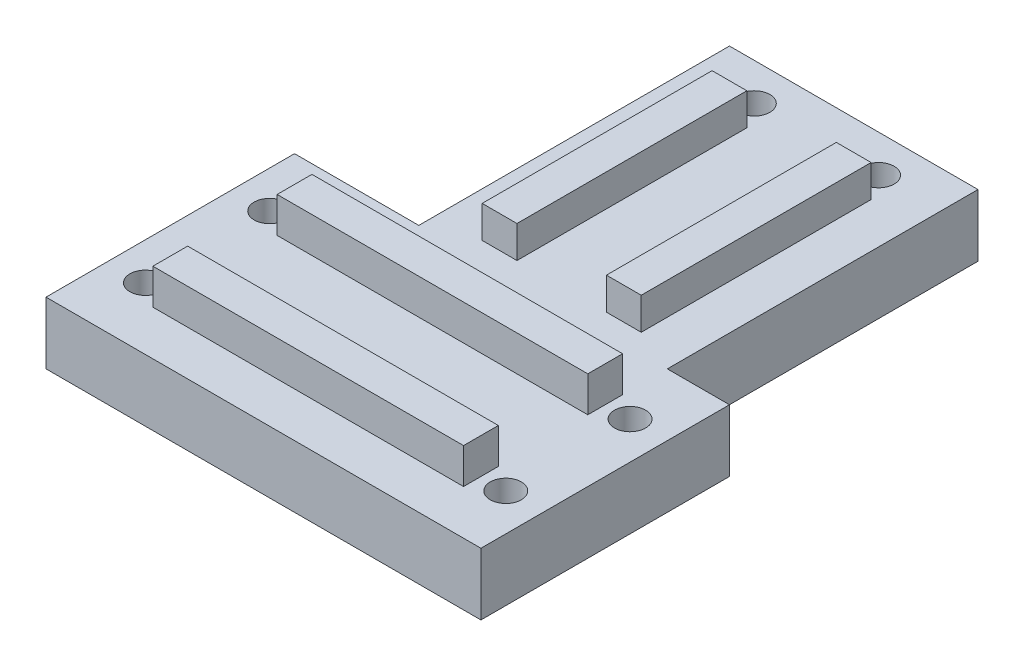
ISO-10303-21;
HEADER;
FILE_DESCRIPTION(('STEP AP214'),'2;1');
FILE_NAME('part.step','',(''),(''),'','','');
FILE_SCHEMA(('AUTOMOTIVE_DESIGN { 1 0 10303 214 1 1 1 1 }'));
ENDSEC;
DATA;
#1=APPLICATION_CONTEXT('core data for automotive mechanical design processes');
#2=APPLICATION_PROTOCOL_DEFINITION('international standard','automotive_design',2000,#1);
#3=PRODUCT_CONTEXT('',#1,'mechanical');
#4=PRODUCT('Part','Part','',(#3));
#5=PRODUCT_RELATED_PRODUCT_CATEGORY('part','',(#4));
#6=PRODUCT_DEFINITION_FORMATION('','',#4);
#7=PRODUCT_DEFINITION_CONTEXT('part definition',#1,'design');
#8=PRODUCT_DEFINITION('design','',#6,#7);
#9=PRODUCT_DEFINITION_SHAPE('','',#8);
#10=(LENGTH_UNIT() NAMED_UNIT(*) SI_UNIT(.MILLI.,.METRE.));
#11=(NAMED_UNIT(*) PLANE_ANGLE_UNIT() SI_UNIT($,.RADIAN.));
#12=(NAMED_UNIT(*) SI_UNIT($,.STERADIAN.) SOLID_ANGLE_UNIT());
#13=UNCERTAINTY_MEASURE_WITH_UNIT(LENGTH_MEASURE(1.E-05),#10,'distance_accuracy_value','');
#14=(GEOMETRIC_REPRESENTATION_CONTEXT(3) GLOBAL_UNCERTAINTY_ASSIGNED_CONTEXT((#13)) GLOBAL_UNIT_ASSIGNED_CONTEXT((#10,
#11,#12)) REPRESENTATION_CONTEXT('',''));
#15=CARTESIAN_POINT('',(0.,0.,0.));
#16=DIRECTION('',(0.,0.,1.));
#17=DIRECTION('',(1.,0.,0.));
#18=AXIS2_PLACEMENT_3D('',#15,#16,#17);
#19=CARTESIAN_POINT('',(30.,10.,7.2));
#20=DIRECTION('',(0.,0.,-1.));
#21=DIRECTION('',(-1.,0.,0.));
#22=AXIS2_PLACEMENT_3D('',#19,#20,#21);
#23=PLANE('',#22);
#24=DIRECTION('',(-1.,0.,0.));
#25=VECTOR('',#24,1.);
#26=CARTESIAN_POINT('',(30.,10.,7.2));
#27=LINE('',#26,#25);
#28=CARTESIAN_POINT('',(20.,10.,7.2));
#29=VERTEX_POINT('',#28);
#30=CARTESIAN_POINT('',(-30.,10.,7.2));
#31=VERTEX_POINT('',#30);
#32=EDGE_CURVE('E243',#29,#31,#27,.T.);
#33=ORIENTED_EDGE('',*,*,#32,.T.);
#34=DIRECTION('',(0.,1.,0.));
#35=VECTOR('',#34,1.);
#36=CARTESIAN_POINT('',(-30.,10.,7.2));
#37=LINE('',#36,#35);
#38=CARTESIAN_POINT('',(-30.,15.7111194530634,7.2));
#39=VERTEX_POINT('',#38);
#40=EDGE_CURVE('E200',#31,#39,#37,.T.);
#41=ORIENTED_EDGE('',*,*,#40,.T.);
#42=DIRECTION('',(-1.,0.,0.));
#43=VECTOR('',#42,1.);
#44=CARTESIAN_POINT('',(30.,15.7111194530634,7.2));
#45=LINE('',#44,#43);
#46=CARTESIAN_POINT('',(20.,15.7111194530634,7.2));
#47=VERTEX_POINT('',#46);
#48=EDGE_CURVE('E223',#47,#39,#45,.T.);
#49=ORIENTED_EDGE('',*,*,#48,.F.);
#50=DIRECTION('',(0.,-1.,0.));
#51=VECTOR('',#50,1.);
#52=CARTESIAN_POINT('',(20.,10.,7.2));
#53=LINE('',#52,#51);
#54=EDGE_CURVE('E288',#47,#29,#53,.T.);
#55=ORIENTED_EDGE('',*,*,#54,.T.);
#56=EDGE_LOOP('',(#33,#41,#49,#55));
#57=FACE_BOUND('',#56,.T.);
#58=ADVANCED_FACE('F34',(#57),#23,.T.);
#59=CARTESIAN_POINT('',(30.,15.7111194530634,7.2));
#60=DIRECTION('',(0.,1.,0.));
#61=DIRECTION('',(0.,0.,1.));
#62=AXIS2_PLACEMENT_3D('',#59,#60,#61);
#63=PLANE('',#62);
#64=ORIENTED_EDGE('',*,*,#48,.T.);
#65=DIRECTION('',(0.,0.,-1.));
#66=VECTOR('',#65,1.);
#67=CARTESIAN_POINT('',(-30.,15.7111194530634,20.));
#68=LINE('',#67,#66);
#69=CARTESIAN_POINT('',(-30.,15.7111194530634,12.8));
#70=VERTEX_POINT('',#69);
#71=EDGE_CURVE('E284',#70,#39,#68,.T.);
#72=ORIENTED_EDGE('',*,*,#71,.F.);
#73=DIRECTION('',(-1.,0.,0.));
#74=VECTOR('',#73,1.);
#75=CARTESIAN_POINT('',(30.,15.7111194530634,12.8));
#76=LINE('',#75,#74);
#77=CARTESIAN_POINT('',(20.,15.7111194530634,12.8));
#78=VERTEX_POINT('',#77);
#79=EDGE_CURVE('E215',#78,#70,#76,.T.);
#80=ORIENTED_EDGE('',*,*,#79,.F.);
#81=DIRECTION('',(0.,0.,1.));
#82=VECTOR('',#81,1.);
#83=CARTESIAN_POINT('',(20.,15.7111194530634,-20.));
#84=LINE('',#83,#82);
#85=EDGE_CURVE('E285',#47,#78,#84,.T.);
#86=ORIENTED_EDGE('',*,*,#85,.F.);
#87=EDGE_LOOP('',(#64,#72,#80,#86));
#88=FACE_BOUND('',#87,.T.);
#89=ADVANCED_FACE('F283',(#88),#63,.T.);
#90=CARTESIAN_POINT('',(30.,15.7111194530634,12.8));
#91=DIRECTION('',(0.,0.,1.));
#92=DIRECTION('',(0.,-1.,0.));
#93=AXIS2_PLACEMENT_3D('',#90,#91,#92);
#94=PLANE('',#93);
#95=ORIENTED_EDGE('',*,*,#79,.T.);
#96=DIRECTION('',(0.,-1.,0.));
#97=VECTOR('',#96,1.);
#98=CARTESIAN_POINT('',(-30.,15.7111194530634,12.8));
#99=LINE('',#98,#97);
#100=CARTESIAN_POINT('',(-30.,10.,12.8));
#101=VERTEX_POINT('',#100);
#102=EDGE_CURVE('E197',#70,#101,#99,.T.);
#103=ORIENTED_EDGE('',*,*,#102,.T.);
#104=DIRECTION('',(-1.,0.,0.));
#105=VECTOR('',#104,1.);
#106=CARTESIAN_POINT('',(30.,10.,12.8));
#107=LINE('',#106,#105);
#108=CARTESIAN_POINT('',(20.,10.,12.8));
#109=VERTEX_POINT('',#108);
#110=EDGE_CURVE('E213',#109,#101,#107,.T.);
#111=ORIENTED_EDGE('',*,*,#110,.F.);
#112=DIRECTION('',(0.,1.,0.));
#113=VECTOR('',#112,1.);
#114=CARTESIAN_POINT('',(20.,15.7111194530634,12.8));
#115=LINE('',#114,#113);
#116=EDGE_CURVE('E654',#109,#78,#115,.T.);
#117=ORIENTED_EDGE('',*,*,#116,.T.);
#118=EDGE_LOOP('',(#95,#103,#111,#117));
#119=FACE_BOUND('',#118,.T.);
#120=ADVANCED_FACE('F211',(#119),#94,.T.);
#121=CARTESIAN_POINT('',(30.,9.99999999999999,-12.8));
#122=DIRECTION('',(0.,0.,-1.));
#123=DIRECTION('',(-1.,0.,0.));
#124=AXIS2_PLACEMENT_3D('',#121,#122,#123);
#125=PLANE('',#124);
#126=DIRECTION('',(-1.,0.,0.));
#127=VECTOR('',#126,1.);
#128=CARTESIAN_POINT('',(30.,9.99999999999999,-12.8));
#129=LINE('',#128,#127);
#130=CARTESIAN_POINT('',(20.,10.,-12.8));
#131=VERTEX_POINT('',#130);
#132=CARTESIAN_POINT('',(-30.,10.,-12.8));
#133=VERTEX_POINT('',#132);
#134=EDGE_CURVE('E221',#131,#133,#129,.T.);
#135=ORIENTED_EDGE('',*,*,#134,.T.);
#136=DIRECTION('',(0.,1.,0.));
#137=VECTOR('',#136,1.);
#138=CARTESIAN_POINT('',(-30.,9.99999999999999,-12.8));
#139=LINE('',#138,#137);
#140=CARTESIAN_POINT('',(-30.,15.7111194530634,-12.8));
#141=VERTEX_POINT('',#140);
#142=EDGE_CURVE('E216',#133,#141,#139,.T.);
#143=ORIENTED_EDGE('',*,*,#142,.T.);
#144=DIRECTION('',(-1.,0.,0.));
#145=VECTOR('',#144,1.);
#146=CARTESIAN_POINT('',(30.,15.7111194530634,-12.8));
#147=LINE('',#146,#145);
#148=CARTESIAN_POINT('',(20.,15.7111194530634,-12.8));
#149=VERTEX_POINT('',#148);
#150=EDGE_CURVE('E226',#149,#141,#147,.T.);
#151=ORIENTED_EDGE('',*,*,#150,.F.);
#152=DIRECTION('',(0.,-1.,0.));
#153=VECTOR('',#152,1.);
#154=CARTESIAN_POINT('',(20.,9.99999999999999,-12.8));
#155=LINE('',#154,#153);
#156=EDGE_CURVE('E651',#149,#131,#155,.T.);
#157=ORIENTED_EDGE('',*,*,#156,.T.);
#158=EDGE_LOOP('',(#135,#143,#151,#157));
#159=FACE_BOUND('',#158,.T.);
#160=ADVANCED_FACE('F427',(#159),#125,.T.);
#161=CARTESIAN_POINT('',(30.,15.7111194530634,-12.8));
#162=DIRECTION('',(0.,1.,0.));
#163=DIRECTION('',(0.,0.,1.));
#164=AXIS2_PLACEMENT_3D('',#161,#162,#163);
#165=PLANE('',#164);
#166=ORIENTED_EDGE('',*,*,#150,.T.);
#167=CARTESIAN_POINT('',(-30.,15.7111194530634,-7.19999999999999));
#168=VERTEX_POINT('',#167);
#169=EDGE_CURVE('E205',#168,#141,#68,.T.);
#170=ORIENTED_EDGE('',*,*,#169,.F.);
#171=DIRECTION('',(-1.,0.,0.));
#172=VECTOR('',#171,1.);
#173=CARTESIAN_POINT('',(30.,15.7111194530634,-7.19999999999999));
#174=LINE('',#173,#172);
#175=CARTESIAN_POINT('',(20.,15.7111194530634,-7.19999999999999));
#176=VERTEX_POINT('',#175);
#177=EDGE_CURVE('E262',#176,#168,#174,.T.);
#178=ORIENTED_EDGE('',*,*,#177,.F.);
#179=EDGE_CURVE('E272',#149,#176,#84,.T.);
#180=ORIENTED_EDGE('',*,*,#179,.F.);
#181=EDGE_LOOP('',(#166,#170,#178,#180));
#182=FACE_BOUND('',#181,.T.);
#183=ADVANCED_FACE('F271',(#182),#165,.T.);
#184=CARTESIAN_POINT('',(30.,15.7111194530634,-7.19999999999999));
#185=DIRECTION('',(0.,0.,1.));
#186=DIRECTION('',(0.,-1.,0.));
#187=AXIS2_PLACEMENT_3D('',#184,#185,#186);
#188=PLANE('',#187);
#189=ORIENTED_EDGE('',*,*,#177,.T.);
#190=DIRECTION('',(0.,-1.,0.));
#191=VECTOR('',#190,1.);
#192=CARTESIAN_POINT('',(-30.,15.7111194530634,-7.19999999999999));
#193=LINE('',#192,#191);
#194=CARTESIAN_POINT('',(-30.,10.,-7.19999999999999));
#195=VERTEX_POINT('',#194);
#196=EDGE_CURVE('E11',#168,#195,#193,.T.);
#197=ORIENTED_EDGE('',*,*,#196,.T.);
#198=DIRECTION('',(-1.,0.,0.));
#199=VECTOR('',#198,1.);
#200=CARTESIAN_POINT('',(30.,9.99999999999999,-7.19999999999999));
#201=LINE('',#200,#199);
#202=CARTESIAN_POINT('',(20.,10.,-7.19999999999999));
#203=VERTEX_POINT('',#202);
#204=EDGE_CURVE('E264',#203,#195,#201,.T.);
#205=ORIENTED_EDGE('',*,*,#204,.F.);
#206=DIRECTION('',(0.,1.,0.));
#207=VECTOR('',#206,1.);
#208=CARTESIAN_POINT('',(20.,15.7111194530634,-7.19999999999999));
#209=LINE('',#208,#207);
#210=EDGE_CURVE('E42',#203,#176,#209,.T.);
#211=ORIENTED_EDGE('',*,*,#210,.T.);
#212=EDGE_LOOP('',(#189,#197,#205,#211));
#213=FACE_BOUND('',#212,.T.);
#214=ADVANCED_FACE('F261',(#213),#188,.T.);
#215=CARTESIAN_POINT('',(-7.2,10.,-23.));
#216=DIRECTION('',(1.,0.,0.));
#217=DIRECTION('',(0.,0.,-1.));
#218=AXIS2_PLACEMENT_3D('',#215,#216,#217);
#219=PLANE('',#218);
#220=DIRECTION('',(0.,0.,-1.));
#221=VECTOR('',#220,1.);
#222=CARTESIAN_POINT('',(-7.2,10.,-23.));
#223=LINE('',#222,#221);
#224=CARTESIAN_POINT('',(-7.2,10.,-23.));
#225=VERTEX_POINT('',#224);
#226=CARTESIAN_POINT('',(-7.2,10.,-60.));
#227=VERTEX_POINT('',#226);
#228=EDGE_CURVE('E334',#225,#227,#223,.T.);
#229=ORIENTED_EDGE('',*,*,#228,.T.);
#230=DIRECTION('',(0.,1.,0.));
#231=VECTOR('',#230,1.);
#232=CARTESIAN_POINT('',(-7.2,10.,-60.));
#233=LINE('',#232,#231);
#234=CARTESIAN_POINT('',(-7.2,15.1656488740256,-60.));
#235=VERTEX_POINT('',#234);
#236=EDGE_CURVE('E649',#227,#235,#233,.T.);
#237=ORIENTED_EDGE('',*,*,#236,.T.);
#238=DIRECTION('',(0.,0.,-1.));
#239=VECTOR('',#238,1.);
#240=CARTESIAN_POINT('',(-7.2,15.1656488740256,-23.));
#241=LINE('',#240,#239);
#242=CARTESIAN_POINT('',(-7.2,15.1656488740256,-23.));
#243=VERTEX_POINT('',#242);
#244=EDGE_CURVE('E338',#243,#235,#241,.T.);
#245=ORIENTED_EDGE('',*,*,#244,.F.);
#246=DIRECTION('',(0.,-1.,0.));
#247=VECTOR('',#246,1.);
#248=CARTESIAN_POINT('',(-7.2,10.,-23.));
#249=LINE('',#248,#247);
#250=EDGE_CURVE('E330',#243,#225,#249,.T.);
#251=ORIENTED_EDGE('',*,*,#250,.T.);
#252=EDGE_LOOP('',(#229,#237,#245,#251));
#253=FACE_BOUND('',#252,.T.);
#254=ADVANCED_FACE('F628',(#253),#219,.T.);
#255=CARTESIAN_POINT('',(-7.2,15.1656488740256,-23.));
#256=DIRECTION('',(0.,1.,0.));
#257=DIRECTION('',(0.,0.,1.));
#258=AXIS2_PLACEMENT_3D('',#255,#256,#257);
#259=PLANE('',#258);
#260=ORIENTED_EDGE('',*,*,#244,.T.);
#261=DIRECTION('',(-1.,0.,0.));
#262=VECTOR('',#261,1.);
#263=CARTESIAN_POINT('',(-7.20000000000001,15.1656488740256,-60.));
#264=LINE('',#263,#262);
#265=CARTESIAN_POINT('',(-12.8,15.1656488740256,-60.));
#266=VERTEX_POINT('',#265);
#267=EDGE_CURVE('E645',#235,#266,#264,.T.);
#268=ORIENTED_EDGE('',*,*,#267,.T.);
#269=DIRECTION('',(0.,0.,-1.));
#270=VECTOR('',#269,1.);
#271=CARTESIAN_POINT('',(-12.8,15.1656488740256,-23.));
#272=LINE('',#271,#270);
#273=CARTESIAN_POINT('',(-12.8,15.1656488740256,-23.));
#274=VERTEX_POINT('',#273);
#275=EDGE_CURVE('E341',#274,#266,#272,.T.);
#276=ORIENTED_EDGE('',*,*,#275,.F.);
#277=DIRECTION('',(1.,0.,0.));
#278=VECTOR('',#277,1.);
#279=CARTESIAN_POINT('',(-7.2,15.1656488740256,-23.));
#280=LINE('',#279,#278);
#281=EDGE_CURVE('E327',#274,#243,#280,.T.);
#282=ORIENTED_EDGE('',*,*,#281,.T.);
#283=EDGE_LOOP('',(#260,#268,#276,#282));
#284=FACE_BOUND('',#283,.T.);
#285=ADVANCED_FACE('F631',(#284),#259,.T.);
#286=CARTESIAN_POINT('',(-12.8,15.1656488740256,-23.));
#287=DIRECTION('',(-1.,0.,0.));
#288=DIRECTION('',(0.,-1.,0.));
#289=AXIS2_PLACEMENT_3D('',#286,#287,#288);
#290=PLANE('',#289);
#291=ORIENTED_EDGE('',*,*,#275,.T.);
#292=DIRECTION('',(0.,-1.,0.));
#293=VECTOR('',#292,1.);
#294=CARTESIAN_POINT('',(-12.8,15.1656488740256,-60.));
#295=LINE('',#294,#293);
#296=CARTESIAN_POINT('',(-12.8,10.,-60.));
#297=VERTEX_POINT('',#296);
#298=EDGE_CURVE('E641',#266,#297,#295,.T.);
#299=ORIENTED_EDGE('',*,*,#298,.T.);
#300=DIRECTION('',(0.,0.,-1.));
#301=VECTOR('',#300,1.);
#302=CARTESIAN_POINT('',(-12.8,10.,-23.));
#303=LINE('',#302,#301);
#304=CARTESIAN_POINT('',(-12.8,10.,-23.));
#305=VERTEX_POINT('',#304);
#306=EDGE_CURVE('E333',#305,#297,#303,.T.);
#307=ORIENTED_EDGE('',*,*,#306,.F.);
#308=DIRECTION('',(0.,1.,0.));
#309=VECTOR('',#308,1.);
#310=CARTESIAN_POINT('',(-12.8,15.1656488740256,-23.));
#311=LINE('',#310,#309);
#312=EDGE_CURVE('E324',#305,#274,#311,.T.);
#313=ORIENTED_EDGE('',*,*,#312,.T.);
#314=EDGE_LOOP('',(#291,#299,#307,#313));
#315=FACE_BOUND('',#314,.T.);
#316=ADVANCED_FACE('F617',(#315),#290,.T.);
#317=CARTESIAN_POINT('',(12.8,10.,-23.));
#318=DIRECTION('',(1.,0.,0.));
#319=DIRECTION('',(0.,0.,-1.));
#320=AXIS2_PLACEMENT_3D('',#317,#318,#319);
#321=PLANE('',#320);
#322=DIRECTION('',(0.,0.,-1.));
#323=VECTOR('',#322,1.);
#324=CARTESIAN_POINT('',(12.8,10.,-23.));
#325=LINE('',#324,#323);
#326=CARTESIAN_POINT('',(12.8,10.,-23.));
#327=VERTEX_POINT('',#326);
#328=CARTESIAN_POINT('',(12.8,10.,-60.));
#329=VERTEX_POINT('',#328);
#330=EDGE_CURVE('E54',#327,#329,#325,.T.);
#331=ORIENTED_EDGE('',*,*,#330,.T.);
#332=DIRECTION('',(0.,1.,0.));
#333=VECTOR('',#332,1.);
#334=CARTESIAN_POINT('',(12.8,10.,-60.));
#335=LINE('',#334,#333);
#336=CARTESIAN_POINT('',(12.8,15.1656488740256,-60.));
#337=VERTEX_POINT('',#336);
#338=EDGE_CURVE('E679',#329,#337,#335,.T.);
#339=ORIENTED_EDGE('',*,*,#338,.T.);
#340=DIRECTION('',(0.,0.,-1.));
#341=VECTOR('',#340,1.);
#342=CARTESIAN_POINT('',(12.8,15.1656488740256,-23.));
#343=LINE('',#342,#341);
#344=CARTESIAN_POINT('',(12.8,15.1656488740256,-23.));
#345=VERTEX_POINT('',#344);
#346=EDGE_CURVE('E316',#345,#337,#343,.T.);
#347=ORIENTED_EDGE('',*,*,#346,.F.);
#348=DIRECTION('',(0.,-1.,0.));
#349=VECTOR('',#348,1.);
#350=CARTESIAN_POINT('',(12.8,10.,-23.));
#351=LINE('',#350,#349);
#352=EDGE_CURVE('E310',#345,#327,#351,.T.);
#353=ORIENTED_EDGE('',*,*,#352,.T.);
#354=EDGE_LOOP('',(#331,#339,#347,#353));
#355=FACE_BOUND('',#354,.T.);
#356=ADVANCED_FACE('F613',(#355),#321,.T.);
#357=CARTESIAN_POINT('',(12.8,15.1656488740256,-23.));
#358=DIRECTION('',(0.,1.,0.));
#359=DIRECTION('',(0.,0.,1.));
#360=AXIS2_PLACEMENT_3D('',#357,#358,#359);
#361=PLANE('',#360);
#362=ORIENTED_EDGE('',*,*,#346,.T.);
#363=DIRECTION('',(-1.,0.,0.));
#364=VECTOR('',#363,1.);
#365=CARTESIAN_POINT('',(12.8,15.1656488740256,-60.));
#366=LINE('',#365,#364);
#367=CARTESIAN_POINT('',(7.19999999999999,15.1656488740256,-60.));
#368=VERTEX_POINT('',#367);
#369=EDGE_CURVE('E676',#337,#368,#366,.T.);
#370=ORIENTED_EDGE('',*,*,#369,.T.);
#371=DIRECTION('',(0.,0.,-1.));
#372=VECTOR('',#371,1.);
#373=CARTESIAN_POINT('',(7.19999999999999,15.1656488740256,-23.));
#374=LINE('',#373,#372);
#375=CARTESIAN_POINT('',(7.19999999999999,15.1656488740256,-23.));
#376=VERTEX_POINT('',#375);
#377=EDGE_CURVE('E319',#376,#368,#374,.T.);
#378=ORIENTED_EDGE('',*,*,#377,.F.);
#379=DIRECTION('',(1.,0.,0.));
#380=VECTOR('',#379,1.);
#381=CARTESIAN_POINT('',(12.8,15.1656488740256,-23.));
#382=LINE('',#381,#380);
#383=EDGE_CURVE('E307',#376,#345,#382,.T.);
#384=ORIENTED_EDGE('',*,*,#383,.T.);
#385=EDGE_LOOP('',(#362,#370,#378,#384));
#386=FACE_BOUND('',#385,.T.);
#387=ADVANCED_FACE('F616',(#386),#361,.T.);
#388=CARTESIAN_POINT('',(7.19999999999999,15.1656488740256,-23.));
#389=DIRECTION('',(-1.,0.,0.));
#390=DIRECTION('',(0.,-1.,0.));
#391=AXIS2_PLACEMENT_3D('',#388,#389,#390);
#392=PLANE('',#391);
#393=ORIENTED_EDGE('',*,*,#377,.T.);
#394=DIRECTION('',(0.,-1.,0.));
#395=VECTOR('',#394,1.);
#396=CARTESIAN_POINT('',(7.19999999999999,15.1656488740256,-60.));
#397=LINE('',#396,#395);
#398=CARTESIAN_POINT('',(7.19999999999999,10.,-60.));
#399=VERTEX_POINT('',#398);
#400=EDGE_CURVE('E254',#368,#399,#397,.T.);
#401=ORIENTED_EDGE('',*,*,#400,.T.);
#402=DIRECTION('',(0.,0.,-1.));
#403=VECTOR('',#402,1.);
#404=CARTESIAN_POINT('',(7.19999999999999,10.,-23.));
#405=LINE('',#404,#403);
#406=CARTESIAN_POINT('',(7.19999999999999,10.,-23.));
#407=VERTEX_POINT('',#406);
#408=EDGE_CURVE('E313',#407,#399,#405,.T.);
#409=ORIENTED_EDGE('',*,*,#408,.F.);
#410=DIRECTION('',(0.,1.,0.));
#411=VECTOR('',#410,1.);
#412=CARTESIAN_POINT('',(7.19999999999999,15.1656488740256,-23.));
#413=LINE('',#412,#411);
#414=EDGE_CURVE('E304',#407,#376,#413,.T.);
#415=ORIENTED_EDGE('',*,*,#414,.T.);
#416=EDGE_LOOP('',(#393,#401,#409,#415));
#417=FACE_BOUND('',#416,.T.);
#418=ADVANCED_FACE('F621',(#417),#392,.T.);
#419=CARTESIAN_POINT('',(-30.,10.,-20.));
#420=DIRECTION('',(0.,0.,1.));
#421=DIRECTION('',(1.,0.,0.));
#422=AXIS2_PLACEMENT_3D('',#419,#420,#421);
#423=PLANE('',#422);
#424=DIRECTION('',(0.,-1.,0.));
#425=VECTOR('',#424,1.);
#426=CARTESIAN_POINT('',(-40.,10.,-20.));
#427=LINE('',#426,#425);
#428=CARTESIAN_POINT('',(-40.,10.,-20.));
#429=VERTEX_POINT('',#428);
#430=CARTESIAN_POINT('',(-40.,0.,-20.));
#431=VERTEX_POINT('',#430);
#432=EDGE_CURVE('E292',#429,#431,#427,.T.);
#433=ORIENTED_EDGE('',*,*,#432,.F.);
#434=DIRECTION('',(-1.,0.,0.));
#435=VECTOR('',#434,1.);
#436=CARTESIAN_POINT('',(30.,10.,-20.));
#437=LINE('',#436,#435);
#438=CARTESIAN_POINT('',(-20.,10.,-20.));
#439=VERTEX_POINT('',#438);
#440=EDGE_CURVE('E235',#439,#429,#437,.T.);
#441=ORIENTED_EDGE('',*,*,#440,.F.);
#442=DIRECTION('',(0.,1.,0.));
#443=VECTOR('',#442,1.);
#444=CARTESIAN_POINT('',(-20.,0.,-20.));
#445=LINE('',#444,#443);
#446=CARTESIAN_POINT('',(-20.,0.,-20.));
#447=VERTEX_POINT('',#446);
#448=EDGE_CURVE('E355',#447,#439,#445,.T.);
#449=ORIENTED_EDGE('',*,*,#448,.F.);
#450=DIRECTION('',(-1.,0.,0.));
#451=VECTOR('',#450,1.);
#452=CARTESIAN_POINT('',(-30.,0.,-20.));
#453=LINE('',#452,#451);
#454=EDGE_CURVE('E246',#447,#431,#453,.T.);
#455=ORIENTED_EDGE('',*,*,#454,.T.);
#456=EDGE_LOOP('',(#433,#441,#449,#455));
#457=FACE_BOUND('',#456,.T.);
#458=ADVANCED_FACE('F379',(#457),#423,.F.);
#459=CARTESIAN_POINT('',(30.,10.,20.));
#460=DIRECTION('',(0.,0.,-1.));
#461=DIRECTION('',(-1.,0.,0.));
#462=AXIS2_PLACEMENT_3D('',#459,#460,#461);
#463=PLANE('',#462);
#464=DIRECTION('',(0.,1.,0.));
#465=VECTOR('',#464,1.);
#466=CARTESIAN_POINT('',(-40.,10.,20.));
#467=LINE('',#466,#465);
#468=CARTESIAN_POINT('',(-40.,0.,20.));
#469=VERTEX_POINT('',#468);
#470=CARTESIAN_POINT('',(-40.,10.,20.));
#471=VERTEX_POINT('',#470);
#472=EDGE_CURVE('E300',#469,#471,#467,.T.);
#473=ORIENTED_EDGE('',*,*,#472,.F.);
#474=DIRECTION('',(1.,0.,0.));
#475=VECTOR('',#474,1.);
#476=CARTESIAN_POINT('',(30.,0.,20.));
#477=LINE('',#476,#475);
#478=CARTESIAN_POINT('',(30.,0.,20.));
#479=VERTEX_POINT('',#478);
#480=EDGE_CURVE('E240',#469,#479,#477,.T.);
#481=ORIENTED_EDGE('',*,*,#480,.T.);
#482=DIRECTION('',(0.,-1.,0.));
#483=VECTOR('',#482,1.);
#484=CARTESIAN_POINT('',(30.,10.,20.));
#485=LINE('',#484,#483);
#486=CARTESIAN_POINT('',(30.,10.,20.));
#487=VERTEX_POINT('',#486);
#488=EDGE_CURVE('E251',#487,#479,#485,.T.);
#489=ORIENTED_EDGE('',*,*,#488,.F.);
#490=DIRECTION('',(1.,0.,0.));
#491=VECTOR('',#490,1.);
#492=CARTESIAN_POINT('',(-30.,10.,20.));
#493=LINE('',#492,#491);
#494=EDGE_CURVE('E230',#471,#487,#493,.T.);
#495=ORIENTED_EDGE('',*,*,#494,.F.);
#496=EDGE_LOOP('',(#473,#481,#489,#495));
#497=FACE_BOUND('',#496,.T.);
#498=ADVANCED_FACE('F36',(#497),#463,.F.);
#499=CARTESIAN_POINT('',(0.,10.,0.));
#500=DIRECTION('',(0.,-1.,0.));
#501=DIRECTION('',(0.,0.,-1.));
#502=AXIS2_PLACEMENT_3D('',#499,#500,#501);
#503=PLANE('',#502);
#504=CARTESIAN_POINT('',(10.,10.,-64.));
#505=DIRECTION('',(0.,1.,0.));
#506=DIRECTION('',(0.,0.,1.));
#507=AXIS2_PLACEMENT_3D('',#504,#505,#506);
#508=CIRCLE('',#507,2.5);
#509=CARTESIAN_POINT('',(10.,10.,-61.5));
#510=VERTEX_POINT('',#509);
#511=EDGE_CURVE('E701',#510,#510,#508,.T.);
#512=ORIENTED_EDGE('',*,*,#511,.F.);
#513=EDGE_LOOP('',(#512));
#514=FACE_BOUND('',#513,.T.);
#515=CARTESIAN_POINT('',(-34.,10.,-10.));
#516=DIRECTION('',(0.,1.,0.));
#517=DIRECTION('',(0.,0.,1.));
#518=AXIS2_PLACEMENT_3D('',#515,#516,#517);
#519=CIRCLE('',#518,2.5);
#520=CARTESIAN_POINT('',(-34.,10.,-7.5));
#521=VERTEX_POINT('',#520);
#522=EDGE_CURVE('E708',#521,#521,#519,.T.);
#523=ORIENTED_EDGE('',*,*,#522,.F.);
#524=EDGE_LOOP('',(#523));
#525=FACE_BOUND('',#524,.T.);
#526=CARTESIAN_POINT('',(-34.,10.,10.));
#527=DIRECTION('',(0.,1.,0.));
#528=DIRECTION('',(0.,0.,1.));
#529=AXIS2_PLACEMENT_3D('',#526,#527,#528);
#530=CIRCLE('',#529,2.5);
#531=CARTESIAN_POINT('',(-34.,10.,12.5));
#532=VERTEX_POINT('',#531);
#533=EDGE_CURVE('E689',#532,#532,#530,.T.);
#534=ORIENTED_EDGE('',*,*,#533,.F.);
#535=EDGE_LOOP('',(#534));
#536=FACE_BOUND('',#535,.T.);
#537=CARTESIAN_POINT('',(24.,10.,-10.));
#538=DIRECTION('',(0.,1.,0.));
#539=DIRECTION('',(0.,0.,1.));
#540=AXIS2_PLACEMENT_3D('',#537,#538,#539);
#541=CIRCLE('',#540,2.5);
#542=CARTESIAN_POINT('',(24.,10.,-7.5));
#543=VERTEX_POINT('',#542);
#544=EDGE_CURVE('E696',#543,#543,#541,.T.);
#545=ORIENTED_EDGE('',*,*,#544,.F.);
#546=EDGE_LOOP('',(#545));
#547=FACE_BOUND('',#546,.T.);
#548=CARTESIAN_POINT('',(-9.99999999999999,10.,-64.));
#549=DIRECTION('',(0.,1.,0.));
#550=DIRECTION('',(0.,0.,1.));
#551=AXIS2_PLACEMENT_3D('',#548,#549,#550);
#552=CIRCLE('',#551,2.5);
#553=CARTESIAN_POINT('',(-9.99999999999999,10.,-61.5));
#554=VERTEX_POINT('',#553);
#555=EDGE_CURVE('E713',#554,#554,#552,.T.);
#556=ORIENTED_EDGE('',*,*,#555,.F.);
#557=EDGE_LOOP('',(#556));
#558=FACE_BOUND('',#557,.T.);
#559=CARTESIAN_POINT('',(24.,10.,10.));
#560=DIRECTION('',(0.,1.,0.));
#561=DIRECTION('',(0.,0.,1.));
#562=AXIS2_PLACEMENT_3D('',#559,#560,#561);
#563=CIRCLE('',#562,2.5);
#564=CARTESIAN_POINT('',(24.,10.,12.5));
#565=VERTEX_POINT('',#564);
#566=EDGE_CURVE('E667',#565,#565,#563,.T.);
#567=ORIENTED_EDGE('',*,*,#566,.F.);
#568=EDGE_LOOP('',(#567));
#569=FACE_BOUND('',#568,.T.);
#570=ORIENTED_EDGE('',*,*,#440,.T.);
#571=DIRECTION('',(0.,0.,-1.));
#572=VECTOR('',#571,1.);
#573=CARTESIAN_POINT('',(-40.,10.,0.));
#574=LINE('',#573,#572);
#575=EDGE_CURVE('E289',#471,#429,#574,.T.);
#576=ORIENTED_EDGE('',*,*,#575,.F.);
#577=ORIENTED_EDGE('',*,*,#494,.T.);
#578=DIRECTION('',(0.,0.,-1.));
#579=VECTOR('',#578,1.);
#580=CARTESIAN_POINT('',(30.,10.,-20.));
#581=LINE('',#580,#579);
#582=CARTESIAN_POINT('',(30.,10.,-20.));
#583=VERTEX_POINT('',#582);
#584=EDGE_CURVE('E232',#487,#583,#581,.T.);
#585=ORIENTED_EDGE('',*,*,#584,.T.);
#586=CARTESIAN_POINT('',(20.,10.,-20.));
#587=VERTEX_POINT('',#586);
#588=EDGE_CURVE('E236',#583,#587,#437,.T.);
#589=ORIENTED_EDGE('',*,*,#588,.T.);
#590=DIRECTION('',(0.,0.,-1.));
#591=VECTOR('',#590,1.);
#592=CARTESIAN_POINT('',(20.,10.,-70.));
#593=LINE('',#592,#591);
#594=CARTESIAN_POINT('',(20.,10.,-70.));
#595=VERTEX_POINT('',#594);
#596=EDGE_CURVE('E357',#587,#595,#593,.T.);
#597=ORIENTED_EDGE('',*,*,#596,.T.);
#598=DIRECTION('',(-1.,0.,0.));
#599=VECTOR('',#598,1.);
#600=CARTESIAN_POINT('',(-20.,10.,-70.));
#601=LINE('',#600,#599);
#602=CARTESIAN_POINT('',(-20.,10.,-70.));
#603=VERTEX_POINT('',#602);
#604=EDGE_CURVE('E349',#595,#603,#601,.T.);
#605=ORIENTED_EDGE('',*,*,#604,.T.);
#606=DIRECTION('',(0.,0.,1.));
#607=VECTOR('',#606,1.);
#608=CARTESIAN_POINT('',(-20.,10.,-70.));
#609=LINE('',#608,#607);
#610=EDGE_CURVE('E337',#603,#439,#609,.T.);
#611=ORIENTED_EDGE('',*,*,#610,.T.);
#612=EDGE_LOOP('',(#570,#576,#577,#585,#589,#597,#605,#611));
#613=FACE_BOUND('',#612,.T.);
#614=ORIENTED_EDGE('',*,*,#306,.T.);
#615=DIRECTION('',(1.,0.,0.));
#616=VECTOR('',#615,1.);
#617=CARTESIAN_POINT('',(20.,10.,-60.));
#618=LINE('',#617,#616);
#619=EDGE_CURVE('E675',#297,#227,#618,.T.);
#620=ORIENTED_EDGE('',*,*,#619,.T.);
#621=ORIENTED_EDGE('',*,*,#228,.F.);
#622=DIRECTION('',(-1.,0.,0.));
#623=VECTOR('',#622,1.);
#624=CARTESIAN_POINT('',(-12.8,10.,-23.));
#625=LINE('',#624,#623);
#626=EDGE_CURVE('E315',#225,#305,#625,.T.);
#627=ORIENTED_EDGE('',*,*,#626,.T.);
#628=EDGE_LOOP('',(#614,#620,#621,#627));
#629=FACE_BOUND('',#628,.T.);
#630=ORIENTED_EDGE('',*,*,#408,.T.);
#631=EDGE_CURVE('E684',#399,#329,#618,.T.);
#632=ORIENTED_EDGE('',*,*,#631,.T.);
#633=ORIENTED_EDGE('',*,*,#330,.F.);
#634=DIRECTION('',(-1.,0.,0.));
#635=VECTOR('',#634,1.);
#636=CARTESIAN_POINT('',(7.19999999999999,10.,-23.));
#637=LINE('',#636,#635);
#638=EDGE_CURVE('E49',#327,#407,#637,.T.);
#639=ORIENTED_EDGE('',*,*,#638,.T.);
#640=EDGE_LOOP('',(#630,#632,#633,#639));
#641=FACE_BOUND('',#640,.T.);
#642=ORIENTED_EDGE('',*,*,#204,.T.);
#643=DIRECTION('',(0.,0.,-1.));
#644=VECTOR('',#643,1.);
#645=CARTESIAN_POINT('',(-30.,10.,20.));
#646=LINE('',#645,#644);
#647=EDGE_CURVE('E206',#195,#133,#646,.T.);
#648=ORIENTED_EDGE('',*,*,#647,.T.);
#649=ORIENTED_EDGE('',*,*,#134,.F.);
#650=DIRECTION('',(0.,0.,1.));
#651=VECTOR('',#650,1.);
#652=CARTESIAN_POINT('',(20.,10.,-20.));
#653=LINE('',#652,#651);
#654=EDGE_CURVE('E673',#131,#203,#653,.T.);
#655=ORIENTED_EDGE('',*,*,#654,.T.);
#656=EDGE_LOOP('',(#642,#648,#649,#655));
#657=FACE_BOUND('',#656,.T.);
#658=EDGE_CURVE('E194',#101,#31,#646,.T.);
#659=ORIENTED_EDGE('',*,*,#658,.T.);
#660=ORIENTED_EDGE('',*,*,#32,.F.);
#661=EDGE_CURVE('E220',#29,#109,#653,.T.);
#662=ORIENTED_EDGE('',*,*,#661,.T.);
#663=ORIENTED_EDGE('',*,*,#110,.T.);
#664=EDGE_LOOP('',(#659,#660,#662,#663));
#665=FACE_BOUND('',#664,.T.);
#666=ADVANCED_FACE('F219',(#514,#525,#536,#547,#558,#569,#613,#629,#641,#657,#665),#503,.F.);
#667=CARTESIAN_POINT('',(0.,0.,0.));
#668=DIRECTION('',(0.,-1.,0.));
#669=DIRECTION('',(0.,0.,-1.));
#670=AXIS2_PLACEMENT_3D('',#667,#668,#669);
#671=PLANE('',#670);
#672=CARTESIAN_POINT('',(10.,0.,-64.));
#673=DIRECTION('',(0.,1.,0.));
#674=DIRECTION('',(0.,0.,1.));
#675=AXIS2_PLACEMENT_3D('',#672,#673,#674);
#676=CIRCLE('',#675,2.5);
#677=CARTESIAN_POINT('',(10.,0.,-61.5));
#678=VERTEX_POINT('',#677);
#679=EDGE_CURVE('E704',#678,#678,#676,.T.);
#680=ORIENTED_EDGE('',*,*,#679,.T.);
#681=EDGE_LOOP('',(#680));
#682=FACE_BOUND('',#681,.T.);
#683=CARTESIAN_POINT('',(-34.,0.,-10.));
#684=DIRECTION('',(0.,1.,0.));
#685=DIRECTION('',(0.,0.,1.));
#686=AXIS2_PLACEMENT_3D('',#683,#684,#685);
#687=CIRCLE('',#686,2.5);
#688=CARTESIAN_POINT('',(-34.,0.,-7.5));
#689=VERTEX_POINT('',#688);
#690=EDGE_CURVE('E693',#689,#689,#687,.T.);
#691=ORIENTED_EDGE('',*,*,#690,.T.);
#692=EDGE_LOOP('',(#691));
#693=FACE_BOUND('',#692,.T.);
#694=CARTESIAN_POINT('',(-34.,0.,10.));
#695=DIRECTION('',(0.,1.,0.));
#696=DIRECTION('',(0.,0.,1.));
#697=AXIS2_PLACEMENT_3D('',#694,#695,#696);
#698=CIRCLE('',#697,2.5);
#699=CARTESIAN_POINT('',(-34.,0.,12.5));
#700=VERTEX_POINT('',#699);
#701=EDGE_CURVE('E692',#700,#700,#698,.T.);
#702=ORIENTED_EDGE('',*,*,#701,.T.);
#703=EDGE_LOOP('',(#702));
#704=FACE_BOUND('',#703,.T.);
#705=CARTESIAN_POINT('',(24.,0.,-10.));
#706=DIRECTION('',(0.,1.,0.));
#707=DIRECTION('',(0.,0.,1.));
#708=AXIS2_PLACEMENT_3D('',#705,#706,#707);
#709=CIRCLE('',#708,2.5);
#710=CARTESIAN_POINT('',(24.,0.,-7.5));
#711=VERTEX_POINT('',#710);
#712=EDGE_CURVE('E687',#711,#711,#709,.T.);
#713=ORIENTED_EDGE('',*,*,#712,.T.);
#714=EDGE_LOOP('',(#713));
#715=FACE_BOUND('',#714,.T.);
#716=CARTESIAN_POINT('',(-9.99999999999999,0.,-64.));
#717=DIRECTION('',(0.,1.,0.));
#718=DIRECTION('',(0.,0.,1.));
#719=AXIS2_PLACEMENT_3D('',#716,#717,#718);
#720=CIRCLE('',#719,2.5);
#721=CARTESIAN_POINT('',(-9.99999999999999,0.,-61.5));
#722=VERTEX_POINT('',#721);
#723=EDGE_CURVE('E705',#722,#722,#720,.T.);
#724=ORIENTED_EDGE('',*,*,#723,.T.);
#725=EDGE_LOOP('',(#724));
#726=FACE_BOUND('',#725,.T.);
#727=CARTESIAN_POINT('',(24.,0.,10.));
#728=DIRECTION('',(0.,1.,0.));
#729=DIRECTION('',(0.,0.,1.));
#730=AXIS2_PLACEMENT_3D('',#727,#728,#729);
#731=CIRCLE('',#730,2.5);
#732=CARTESIAN_POINT('',(24.,0.,12.5));
#733=VERTEX_POINT('',#732);
#734=EDGE_CURVE('E665',#733,#733,#731,.T.);
#735=ORIENTED_EDGE('',*,*,#734,.T.);
#736=EDGE_LOOP('',(#735));
#737=FACE_BOUND('',#736,.T.);
#738=ORIENTED_EDGE('',*,*,#480,.F.);
#739=DIRECTION('',(0.,0.,-1.));
#740=VECTOR('',#739,1.);
#741=CARTESIAN_POINT('',(-40.,0.,0.));
#742=LINE('',#741,#740);
#743=EDGE_CURVE('E297',#469,#431,#742,.T.);
#744=ORIENTED_EDGE('',*,*,#743,.T.);
#745=ORIENTED_EDGE('',*,*,#454,.F.);
#746=DIRECTION('',(0.,0.,1.));
#747=VECTOR('',#746,1.);
#748=CARTESIAN_POINT('',(-20.,0.,-70.));
#749=LINE('',#748,#747);
#750=CARTESIAN_POINT('',(-20.,0.,-70.));
#751=VERTEX_POINT('',#750);
#752=EDGE_CURVE('E346',#751,#447,#749,.T.);
#753=ORIENTED_EDGE('',*,*,#752,.F.);
#754=DIRECTION('',(-1.,0.,0.));
#755=VECTOR('',#754,1.);
#756=CARTESIAN_POINT('',(-20.,0.,-70.));
#757=LINE('',#756,#755);
#758=CARTESIAN_POINT('',(20.,0.,-70.));
#759=VERTEX_POINT('',#758);
#760=EDGE_CURVE('E352',#759,#751,#757,.T.);
#761=ORIENTED_EDGE('',*,*,#760,.F.);
#762=DIRECTION('',(0.,0.,-1.));
#763=VECTOR('',#762,1.);
#764=CARTESIAN_POINT('',(20.,0.,-70.));
#765=LINE('',#764,#763);
#766=CARTESIAN_POINT('',(20.,0.,-20.));
#767=VERTEX_POINT('',#766);
#768=EDGE_CURVE('E348',#767,#759,#765,.T.);
#769=ORIENTED_EDGE('',*,*,#768,.F.);
#770=CARTESIAN_POINT('',(30.,0.,-20.));
#771=VERTEX_POINT('',#770);
#772=EDGE_CURVE('E233',#771,#767,#453,.T.);
#773=ORIENTED_EDGE('',*,*,#772,.F.);
#774=DIRECTION('',(0.,0.,-1.));
#775=VECTOR('',#774,1.);
#776=CARTESIAN_POINT('',(30.,0.,-20.));
#777=LINE('',#776,#775);
#778=EDGE_CURVE('E242',#479,#771,#777,.T.);
#779=ORIENTED_EDGE('',*,*,#778,.F.);
#780=EDGE_LOOP('',(#738,#744,#745,#753,#761,#769,#773,#779));
#781=FACE_BOUND('',#780,.T.);
#782=ADVANCED_FACE('F402',(#682,#693,#704,#715,#726,#737,#781),#671,.T.);
#783=CARTESIAN_POINT('',(30.,10.,-20.));
#784=DIRECTION('',(-1.,0.,0.));
#785=DIRECTION('',(0.,0.,1.));
#786=AXIS2_PLACEMENT_3D('',#783,#784,#785);
#787=PLANE('',#786);
#788=DIRECTION('',(0.,-1.,0.));
#789=VECTOR('',#788,1.);
#790=CARTESIAN_POINT('',(30.,10.,-20.));
#791=LINE('',#790,#789);
#792=EDGE_CURVE('E239',#583,#771,#791,.T.);
#793=ORIENTED_EDGE('',*,*,#792,.F.);
#794=ORIENTED_EDGE('',*,*,#584,.F.);
#795=ORIENTED_EDGE('',*,*,#488,.T.);
#796=ORIENTED_EDGE('',*,*,#778,.T.);
#797=EDGE_LOOP('',(#793,#794,#795,#796));
#798=FACE_BOUND('',#797,.T.);
#799=ADVANCED_FACE('F393',(#798),#787,.F.);
#800=ORIENTED_EDGE('',*,*,#772,.T.);
#801=DIRECTION('',(0.,1.,0.));
#802=VECTOR('',#801,1.);
#803=CARTESIAN_POINT('',(20.,0.,-20.));
#804=LINE('',#803,#802);
#805=EDGE_CURVE('E365',#767,#587,#804,.T.);
#806=ORIENTED_EDGE('',*,*,#805,.T.);
#807=ORIENTED_EDGE('',*,*,#588,.F.);
#808=ORIENTED_EDGE('',*,*,#792,.T.);
#809=EDGE_LOOP('',(#800,#806,#807,#808));
#810=FACE_BOUND('',#809,.T.);
#811=ADVANCED_FACE('F396',(#810),#423,.F.);
#812=CARTESIAN_POINT('',(-20.,0.,-70.));
#813=DIRECTION('',(-1.,0.,0.));
#814=DIRECTION('',(0.,0.,1.));
#815=AXIS2_PLACEMENT_3D('',#812,#813,#814);
#816=PLANE('',#815);
#817=ORIENTED_EDGE('',*,*,#610,.F.);
#818=DIRECTION('',(0.,1.,0.));
#819=VECTOR('',#818,1.);
#820=CARTESIAN_POINT('',(-20.,0.,-70.));
#821=LINE('',#820,#819);
#822=EDGE_CURVE('E276',#751,#603,#821,.T.);
#823=ORIENTED_EDGE('',*,*,#822,.F.);
#824=ORIENTED_EDGE('',*,*,#752,.T.);
#825=ORIENTED_EDGE('',*,*,#448,.T.);
#826=EDGE_LOOP('',(#817,#823,#824,#825));
#827=FACE_BOUND('',#826,.T.);
#828=ADVANCED_FACE('F373',(#827),#816,.T.);
#829=CARTESIAN_POINT('',(-20.,0.,-70.));
#830=DIRECTION('',(0.,0.,-1.));
#831=DIRECTION('',(-1.,0.,0.));
#832=AXIS2_PLACEMENT_3D('',#829,#830,#831);
#833=PLANE('',#832);
#834=ORIENTED_EDGE('',*,*,#822,.T.);
#835=ORIENTED_EDGE('',*,*,#604,.F.);
#836=DIRECTION('',(0.,1.,0.));
#837=VECTOR('',#836,1.);
#838=CARTESIAN_POINT('',(20.,0.,-70.));
#839=LINE('',#838,#837);
#840=EDGE_CURVE('E362',#759,#595,#839,.T.);
#841=ORIENTED_EDGE('',*,*,#840,.F.);
#842=ORIENTED_EDGE('',*,*,#760,.T.);
#843=EDGE_LOOP('',(#834,#835,#841,#842));
#844=FACE_BOUND('',#843,.T.);
#845=ADVANCED_FACE('F404',(#844),#833,.T.);
#846=CARTESIAN_POINT('',(20.,0.,-70.));
#847=DIRECTION('',(1.,0.,0.));
#848=DIRECTION('',(0.,0.,-1.));
#849=AXIS2_PLACEMENT_3D('',#846,#847,#848);
#850=PLANE('',#849);
#851=ORIENTED_EDGE('',*,*,#596,.F.);
#852=ORIENTED_EDGE('',*,*,#805,.F.);
#853=ORIENTED_EDGE('',*,*,#768,.T.);
#854=ORIENTED_EDGE('',*,*,#840,.T.);
#855=EDGE_LOOP('',(#851,#852,#853,#854));
#856=FACE_BOUND('',#855,.T.);
#857=ADVANCED_FACE('F399',(#856),#850,.T.);
#858=CARTESIAN_POINT('',(0.,0.,-23.));
#859=DIRECTION('',(0.,0.,1.));
#860=DIRECTION('',(1.,0.,0.));
#861=AXIS2_PLACEMENT_3D('',#858,#859,#860);
#862=PLANE('',#861);
#863=ORIENTED_EDGE('',*,*,#626,.F.);
#864=ORIENTED_EDGE('',*,*,#250,.F.);
#865=ORIENTED_EDGE('',*,*,#281,.F.);
#866=ORIENTED_EDGE('',*,*,#312,.F.);
#867=EDGE_LOOP('',(#863,#864,#865,#866));
#868=FACE_BOUND('',#867,.T.);
#869=ADVANCED_FACE('F412',(#868),#862,.T.);
#870=CARTESIAN_POINT('',(0.,0.,-23.));
#871=DIRECTION('',(0.,0.,1.));
#872=DIRECTION('',(1.,0.,0.));
#873=AXIS2_PLACEMENT_3D('',#870,#871,#872);
#874=PLANE('',#873);
#875=ORIENTED_EDGE('',*,*,#638,.F.);
#876=ORIENTED_EDGE('',*,*,#352,.F.);
#877=ORIENTED_EDGE('',*,*,#383,.F.);
#878=ORIENTED_EDGE('',*,*,#414,.F.);
#879=EDGE_LOOP('',(#875,#876,#877,#878));
#880=FACE_BOUND('',#879,.T.);
#881=ADVANCED_FACE('F473',(#880),#874,.T.);
#882=CARTESIAN_POINT('',(-40.,0.,0.));
#883=DIRECTION('',(-1.,0.,0.));
#884=DIRECTION('',(0.,0.,1.));
#885=AXIS2_PLACEMENT_3D('',#882,#883,#884);
#886=PLANE('',#885);
#887=ORIENTED_EDGE('',*,*,#575,.T.);
#888=ORIENTED_EDGE('',*,*,#432,.T.);
#889=ORIENTED_EDGE('',*,*,#743,.F.);
#890=ORIENTED_EDGE('',*,*,#472,.T.);
#891=EDGE_LOOP('',(#887,#888,#889,#890));
#892=FACE_BOUND('',#891,.T.);
#893=ADVANCED_FACE('F383',(#892),#886,.T.);
#894=CARTESIAN_POINT('',(-30.,15.7111194530634,20.));
#895=DIRECTION('',(-1.,0.,0.));
#896=DIRECTION('',(0.,0.,1.));
#897=AXIS2_PLACEMENT_3D('',#894,#895,#896);
#898=PLANE('',#897);
#899=ORIENTED_EDGE('',*,*,#658,.F.);
#900=ORIENTED_EDGE('',*,*,#102,.F.);
#901=ORIENTED_EDGE('',*,*,#71,.T.);
#902=ORIENTED_EDGE('',*,*,#40,.F.);
#903=EDGE_LOOP('',(#899,#900,#901,#902));
#904=FACE_BOUND('',#903,.T.);
#905=ADVANCED_FACE('F196',(#904),#898,.T.);
#906=ORIENTED_EDGE('',*,*,#647,.F.);
#907=ORIENTED_EDGE('',*,*,#196,.F.);
#908=ORIENTED_EDGE('',*,*,#169,.T.);
#909=ORIENTED_EDGE('',*,*,#142,.F.);
#910=EDGE_LOOP('',(#906,#907,#908,#909));
#911=FACE_BOUND('',#910,.T.);
#912=ADVANCED_FACE('F485',(#911),#898,.T.);
#913=CARTESIAN_POINT('',(20.,15.7111194530634,-60.));
#914=DIRECTION('',(0.,0.,-1.));
#915=DIRECTION('',(-1.,0.,0.));
#916=AXIS2_PLACEMENT_3D('',#913,#914,#915);
#917=PLANE('',#916);
#918=ORIENTED_EDGE('',*,*,#631,.F.);
#919=ORIENTED_EDGE('',*,*,#400,.F.);
#920=ORIENTED_EDGE('',*,*,#369,.F.);
#921=ORIENTED_EDGE('',*,*,#338,.F.);
#922=EDGE_LOOP('',(#918,#919,#920,#921));
#923=FACE_BOUND('',#922,.T.);
#924=ADVANCED_FACE('F495',(#923),#917,.T.);
#925=ORIENTED_EDGE('',*,*,#619,.F.);
#926=ORIENTED_EDGE('',*,*,#298,.F.);
#927=ORIENTED_EDGE('',*,*,#267,.F.);
#928=ORIENTED_EDGE('',*,*,#236,.F.);
#929=EDGE_LOOP('',(#925,#926,#927,#928));
#930=FACE_BOUND('',#929,.T.);
#931=ADVANCED_FACE('F504',(#930),#917,.T.);
#932=CARTESIAN_POINT('',(20.,15.7111194530634,-20.));
#933=DIRECTION('',(1.,0.,0.));
#934=DIRECTION('',(0.,0.,-1.));
#935=AXIS2_PLACEMENT_3D('',#932,#933,#934);
#936=PLANE('',#935);
#937=ORIENTED_EDGE('',*,*,#85,.T.);
#938=ORIENTED_EDGE('',*,*,#116,.F.);
#939=ORIENTED_EDGE('',*,*,#661,.F.);
#940=ORIENTED_EDGE('',*,*,#54,.F.);
#941=EDGE_LOOP('',(#937,#938,#939,#940));
#942=FACE_BOUND('',#941,.T.);
#943=ADVANCED_FACE('F514',(#942),#936,.T.);
#944=ORIENTED_EDGE('',*,*,#179,.T.);
#945=ORIENTED_EDGE('',*,*,#210,.F.);
#946=ORIENTED_EDGE('',*,*,#654,.F.);
#947=ORIENTED_EDGE('',*,*,#156,.F.);
#948=EDGE_LOOP('',(#944,#945,#946,#947));
#949=FACE_BOUND('',#948,.T.);
#950=ADVANCED_FACE('F523',(#949),#936,.T.);
#951=CARTESIAN_POINT('',(24.,0.,10.));
#952=DIRECTION('',(0.,1.,0.));
#953=DIRECTION('',(0.,0.,1.));
#954=AXIS2_PLACEMENT_3D('',#951,#952,#953);
#955=CYLINDRICAL_SURFACE('',#954,2.5);
#956=ORIENTED_EDGE('',*,*,#734,.F.);
#957=EDGE_LOOP('',(#956));
#958=FACE_BOUND('',#957,.T.);
#959=ORIENTED_EDGE('',*,*,#566,.T.);
#960=EDGE_LOOP('',(#959));
#961=FACE_BOUND('',#960,.T.);
#962=ADVANCED_FACE('F533',(#958,#961),#955,.F.);
#963=CARTESIAN_POINT('',(-9.99999999999999,0.,-64.));
#964=DIRECTION('',(0.,1.,0.));
#965=DIRECTION('',(0.,0.,1.));
#966=AXIS2_PLACEMENT_3D('',#963,#964,#965);
#967=CYLINDRICAL_SURFACE('',#966,2.5);
#968=ORIENTED_EDGE('',*,*,#723,.F.);
#969=EDGE_LOOP('',(#968));
#970=FACE_BOUND('',#969,.T.);
#971=ORIENTED_EDGE('',*,*,#555,.T.);
#972=EDGE_LOOP('',(#971));
#973=FACE_BOUND('',#972,.T.);
#974=ADVANCED_FACE('F554',(#970,#973),#967,.F.);
#975=CARTESIAN_POINT('',(24.,0.,-10.));
#976=DIRECTION('',(0.,1.,0.));
#977=DIRECTION('',(0.,0.,1.));
#978=AXIS2_PLACEMENT_3D('',#975,#976,#977);
#979=CYLINDRICAL_SURFACE('',#978,2.5);
#980=ORIENTED_EDGE('',*,*,#712,.F.);
#981=EDGE_LOOP('',(#980));
#982=FACE_BOUND('',#981,.T.);
#983=ORIENTED_EDGE('',*,*,#544,.T.);
#984=EDGE_LOOP('',(#983));
#985=FACE_BOUND('',#984,.T.);
#986=ADVANCED_FACE('F564',(#982,#985),#979,.F.);
#987=CARTESIAN_POINT('',(-34.,0.,10.));
#988=DIRECTION('',(0.,1.,0.));
#989=DIRECTION('',(0.,0.,1.));
#990=AXIS2_PLACEMENT_3D('',#987,#988,#989);
#991=CYLINDRICAL_SURFACE('',#990,2.5);
#992=ORIENTED_EDGE('',*,*,#701,.F.);
#993=EDGE_LOOP('',(#992));
#994=FACE_BOUND('',#993,.T.);
#995=ORIENTED_EDGE('',*,*,#533,.T.);
#996=EDGE_LOOP('',(#995));
#997=FACE_BOUND('',#996,.T.);
#998=ADVANCED_FACE('F574',(#994,#997),#991,.F.);
#999=CARTESIAN_POINT('',(-34.,0.,-10.));
#1000=DIRECTION('',(0.,1.,0.));
#1001=DIRECTION('',(0.,0.,1.));
#1002=AXIS2_PLACEMENT_3D('',#999,#1000,#1001);
#1003=CYLINDRICAL_SURFACE('',#1002,2.5);
#1004=ORIENTED_EDGE('',*,*,#690,.F.);
#1005=EDGE_LOOP('',(#1004));
#1006=FACE_BOUND('',#1005,.T.);
#1007=ORIENTED_EDGE('',*,*,#522,.T.);
#1008=EDGE_LOOP('',(#1007));
#1009=FACE_BOUND('',#1008,.T.);
#1010=ADVANCED_FACE('F584',(#1006,#1009),#1003,.F.);
#1011=CARTESIAN_POINT('',(10.,0.,-64.));
#1012=DIRECTION('',(0.,1.,0.));
#1013=DIRECTION('',(0.,0.,1.));
#1014=AXIS2_PLACEMENT_3D('',#1011,#1012,#1013);
#1015=CYLINDRICAL_SURFACE('',#1014,2.5);
#1016=ORIENTED_EDGE('',*,*,#679,.F.);
#1017=EDGE_LOOP('',(#1016));
#1018=FACE_BOUND('',#1017,.T.);
#1019=ORIENTED_EDGE('',*,*,#511,.T.);
#1020=EDGE_LOOP('',(#1019));
#1021=FACE_BOUND('',#1020,.T.);
#1022=ADVANCED_FACE('F594',(#1018,#1021),#1015,.F.);
#1023=CLOSED_SHELL('',(#58,#89,#120,#160,#183,#214,#254,#285,#316,#356,#387,#418,#458,#498,#666,
#782,#799,#811,#828,#845,#857,#869,#881,#893,#905,#912,#924,#931,#943,#950,#962,#974,#986,#998,
#1010,#1022));
#1024=MANIFOLD_SOLID_BREP('B2',#1023);
#1025=ADVANCED_BREP_SHAPE_REPRESENTATION('',(#18,#1024),#14);
#1026=SHAPE_DEFINITION_REPRESENTATION(#9,#1025);
ENDSEC;
END-ISO-10303-21;
